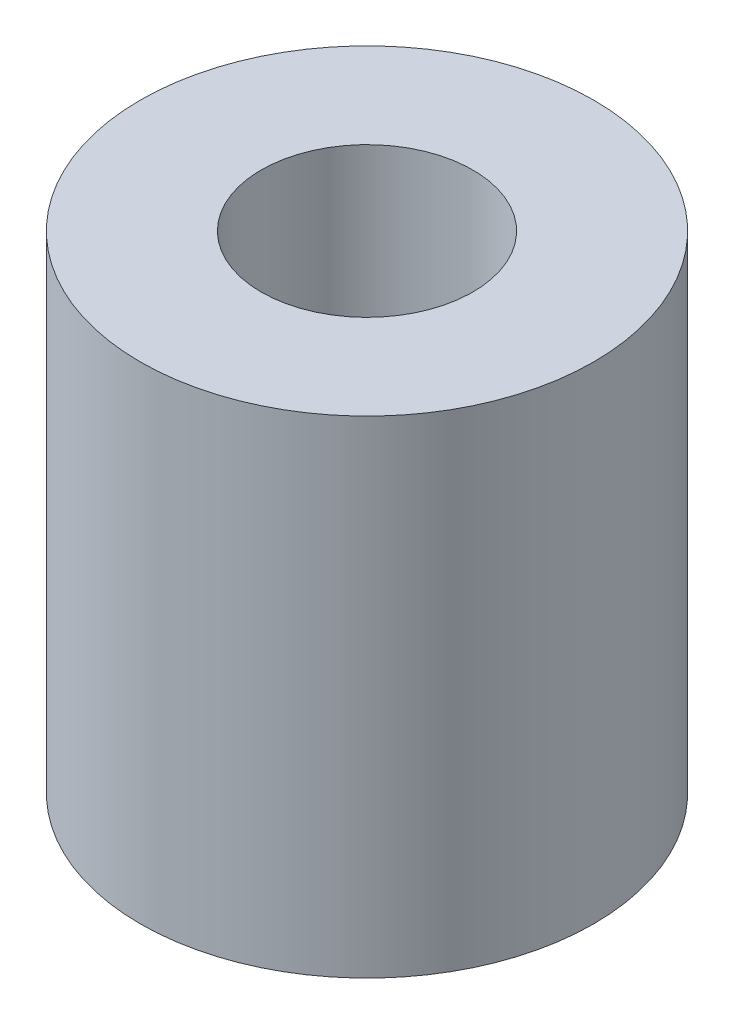
ISO-10303-21;
HEADER;
FILE_DESCRIPTION(('STEP AP214'),'2;1');
FILE_NAME('part.step','',(''),(''),'','','');
FILE_SCHEMA(('AUTOMOTIVE_DESIGN { 1 0 10303 214 1 1 1 1 }'));
ENDSEC;
DATA;
#1=APPLICATION_CONTEXT('core data for automotive mechanical design processes');
#2=APPLICATION_PROTOCOL_DEFINITION('international standard','automotive_design',2000,#1);
#3=PRODUCT_CONTEXT('',#1,'mechanical');
#4=PRODUCT('Part','Part','',(#3));
#5=PRODUCT_RELATED_PRODUCT_CATEGORY('part','',(#4));
#6=PRODUCT_DEFINITION_FORMATION('','',#4);
#7=PRODUCT_DEFINITION_CONTEXT('part definition',#1,'design');
#8=PRODUCT_DEFINITION('design','',#6,#7);
#9=PRODUCT_DEFINITION_SHAPE('','',#8);
#10=(LENGTH_UNIT() NAMED_UNIT(*) SI_UNIT(.MILLI.,.METRE.));
#11=(NAMED_UNIT(*) PLANE_ANGLE_UNIT() SI_UNIT($,.RADIAN.));
#12=(NAMED_UNIT(*) SI_UNIT($,.STERADIAN.) SOLID_ANGLE_UNIT());
#13=UNCERTAINTY_MEASURE_WITH_UNIT(LENGTH_MEASURE(1.E-05),#10,'distance_accuracy_value','');
#14=(GEOMETRIC_REPRESENTATION_CONTEXT(3) GLOBAL_UNCERTAINTY_ASSIGNED_CONTEXT((#13)) GLOBAL_UNIT_ASSIGNED_CONTEXT((#10,
#11,#12)) REPRESENTATION_CONTEXT('',''));
#15=CARTESIAN_POINT('',(0.,0.,0.));
#16=DIRECTION('',(0.,0.,1.));
#17=DIRECTION('',(1.,0.,0.));
#18=AXIS2_PLACEMENT_3D('',#15,#16,#17);
#19=CARTESIAN_POINT('',(0.,8.05,0.));
#20=DIRECTION('',(0.,1.,0.));
#21=DIRECTION('',(0.,0.,1.));
#22=AXIS2_PLACEMENT_3D('',#19,#20,#21);
#23=PLANE('',#22);
#24=CARTESIAN_POINT('',(0.,8.05,0.));
#25=DIRECTION('',(0.,1.,0.));
#26=DIRECTION('',(0.,0.,1.));
#27=AXIS2_PLACEMENT_3D('',#24,#25,#26);
#28=CIRCLE('',#27,3.75);
#29=CARTESIAN_POINT('',(0.,8.05,3.75));
#30=VERTEX_POINT('',#29);
#31=EDGE_CURVE('E10',#30,#30,#28,.T.);
#32=ORIENTED_EDGE('',*,*,#31,.T.);
#33=EDGE_LOOP('',(#32));
#34=FACE_BOUND('',#33,.T.);
#35=CARTESIAN_POINT('',(0.,8.05,0.));
#36=DIRECTION('',(0.,1.,0.));
#37=DIRECTION('',(0.,0.,1.));
#38=AXIS2_PLACEMENT_3D('',#35,#36,#37);
#39=CIRCLE('',#38,1.75);
#40=CARTESIAN_POINT('',(0.,8.05,1.75));
#41=VERTEX_POINT('',#40);
#42=EDGE_CURVE('E56',#41,#41,#39,.T.);
#43=ORIENTED_EDGE('',*,*,#42,.F.);
#44=EDGE_LOOP('',(#43));
#45=FACE_BOUND('',#44,.T.);
#46=ADVANCED_FACE('F43',(#34,#45),#23,.T.);
#47=CARTESIAN_POINT('',(0.,0.,0.));
#48=DIRECTION('',(0.,1.,0.));
#49=DIRECTION('',(0.,0.,1.));
#50=AXIS2_PLACEMENT_3D('',#47,#48,#49);
#51=PLANE('',#50);
#52=CARTESIAN_POINT('',(0.,0.,0.));
#53=DIRECTION('',(0.,1.,0.));
#54=DIRECTION('',(0.,0.,1.));
#55=AXIS2_PLACEMENT_3D('',#52,#53,#54);
#56=CIRCLE('',#55,3.75);
#57=CARTESIAN_POINT('',(0.,0.,3.75));
#58=VERTEX_POINT('',#57);
#59=EDGE_CURVE('E47',#58,#58,#56,.T.);
#60=ORIENTED_EDGE('',*,*,#59,.F.);
#61=EDGE_LOOP('',(#60));
#62=FACE_BOUND('',#61,.T.);
#63=CARTESIAN_POINT('',(0.,0.,0.));
#64=DIRECTION('',(0.,1.,0.));
#65=DIRECTION('',(0.,0.,1.));
#66=AXIS2_PLACEMENT_3D('',#63,#64,#65);
#67=CIRCLE('',#66,1.75);
#68=CARTESIAN_POINT('',(0.,0.,1.75));
#69=VERTEX_POINT('',#68);
#70=EDGE_CURVE('E58',#69,#69,#67,.T.);
#71=ORIENTED_EDGE('',*,*,#70,.T.);
#72=EDGE_LOOP('',(#71));
#73=FACE_BOUND('',#72,.T.);
#74=ADVANCED_FACE('F70',(#62,#73),#51,.F.);
#75=CARTESIAN_POINT('',(0.,8.05,0.));
#76=DIRECTION('',(0.,-1.,0.));
#77=DIRECTION('',(0.,0.,-1.));
#78=AXIS2_PLACEMENT_3D('',#75,#76,#77);
#79=CYLINDRICAL_SURFACE('',#78,3.75);
#80=ORIENTED_EDGE('',*,*,#31,.F.);
#81=EDGE_LOOP('',(#80));
#82=FACE_BOUND('',#81,.T.);
#83=ORIENTED_EDGE('',*,*,#59,.T.);
#84=EDGE_LOOP('',(#83));
#85=FACE_BOUND('',#84,.T.);
#86=ADVANCED_FACE('F45',(#82,#85),#79,.T.);
#87=CARTESIAN_POINT('',(0.,8.05,0.));
#88=DIRECTION('',(0.,-1.,0.));
#89=DIRECTION('',(0.,0.,-1.));
#90=AXIS2_PLACEMENT_3D('',#87,#88,#89);
#91=CYLINDRICAL_SURFACE('',#90,1.75);
#92=ORIENTED_EDGE('',*,*,#42,.T.);
#93=EDGE_LOOP('',(#92));
#94=FACE_BOUND('',#93,.T.);
#95=ORIENTED_EDGE('',*,*,#70,.F.);
#96=EDGE_LOOP('',(#95));
#97=FACE_BOUND('',#96,.T.);
#98=ADVANCED_FACE('F66',(#94,#97),#91,.F.);
#99=CLOSED_SHELL('',(#46,#74,#86,#98));
#100=MANIFOLD_SOLID_BREP('B2',#99);
#101=ADVANCED_BREP_SHAPE_REPRESENTATION('',(#18,#100),#14);
#102=SHAPE_DEFINITION_REPRESENTATION(#9,#101);
ENDSEC;
END-ISO-10303-21;
